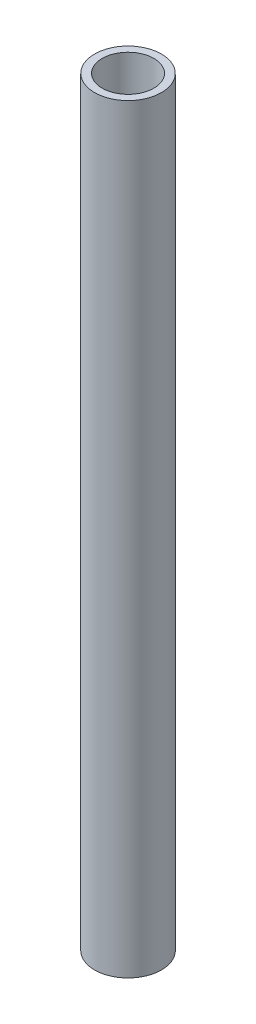
ISO-10303-21;
HEADER;
FILE_DESCRIPTION(('STEP AP214'),'2;1');
FILE_NAME('part.step','',(''),(''),'','','');
FILE_SCHEMA(('AUTOMOTIVE_DESIGN { 1 0 10303 214 1 1 1 1 }'));
ENDSEC;
DATA;
#1=APPLICATION_CONTEXT('core data for automotive mechanical design processes');
#2=APPLICATION_PROTOCOL_DEFINITION('international standard','automotive_design',2000,#1);
#3=PRODUCT_CONTEXT('',#1,'mechanical');
#4=PRODUCT('Part','Part','',(#3));
#5=PRODUCT_RELATED_PRODUCT_CATEGORY('part','',(#4));
#6=PRODUCT_DEFINITION_FORMATION('','',#4);
#7=PRODUCT_DEFINITION_CONTEXT('part definition',#1,'design');
#8=PRODUCT_DEFINITION('design','',#6,#7);
#9=PRODUCT_DEFINITION_SHAPE('','',#8);
#10=(LENGTH_UNIT() NAMED_UNIT(*) SI_UNIT(.MILLI.,.METRE.));
#11=(NAMED_UNIT(*) PLANE_ANGLE_UNIT() SI_UNIT($,.RADIAN.));
#12=(NAMED_UNIT(*) SI_UNIT($,.STERADIAN.) SOLID_ANGLE_UNIT());
#13=UNCERTAINTY_MEASURE_WITH_UNIT(LENGTH_MEASURE(1.E-05),#10,'distance_accuracy_value','');
#14=(GEOMETRIC_REPRESENTATION_CONTEXT(3) GLOBAL_UNCERTAINTY_ASSIGNED_CONTEXT((#13)) GLOBAL_UNIT_ASSIGNED_CONTEXT((#10,
#11,#12)) REPRESENTATION_CONTEXT('',''));
#15=CARTESIAN_POINT('',(0.,0.,0.));
#16=DIRECTION('',(0.,0.,1.));
#17=DIRECTION('',(1.,0.,0.));
#18=AXIS2_PLACEMENT_3D('',#15,#16,#17);
#19=CARTESIAN_POINT('',(0.,300.,0.));
#20=DIRECTION('',(0.,1.,0.));
#21=DIRECTION('',(0.,0.,1.));
#22=AXIS2_PLACEMENT_3D('',#19,#20,#21);
#23=PLANE('',#22);
#24=CARTESIAN_POINT('',(0.,300.,0.));
#25=DIRECTION('',(0.,1.,0.));
#26=DIRECTION('',(1.,0.,0.));
#27=AXIS2_PLACEMENT_3D('',#24,#25,#26);
#28=CIRCLE('',#27,13.2);
#29=CARTESIAN_POINT('',(13.2,300.,0.));
#30=VERTEX_POINT('',#29);
#31=EDGE_CURVE('E11',#30,#30,#28,.T.);
#32=ORIENTED_EDGE('',*,*,#31,.T.);
#33=EDGE_LOOP('',(#32));
#34=FACE_BOUND('',#33,.T.);
#35=CARTESIAN_POINT('',(0.,300.,0.));
#36=DIRECTION('',(0.,1.,0.));
#37=DIRECTION('',(0.,0.,1.));
#38=AXIS2_PLACEMENT_3D('',#35,#36,#37);
#39=CIRCLE('',#38,10.2);
#40=CARTESIAN_POINT('',(0.,300.,10.2));
#41=VERTEX_POINT('',#40);
#42=EDGE_CURVE('E48',#41,#41,#39,.T.);
#43=ORIENTED_EDGE('',*,*,#42,.F.);
#44=EDGE_LOOP('',(#43));
#45=FACE_BOUND('',#44,.T.);
#46=ADVANCED_FACE('F37',(#34,#45),#23,.T.);
#47=CARTESIAN_POINT('',(0.,0.,0.));
#48=DIRECTION('',(0.,1.,0.));
#49=DIRECTION('',(0.,0.,1.));
#50=AXIS2_PLACEMENT_3D('',#47,#48,#49);
#51=PLANE('',#50);
#52=CARTESIAN_POINT('',(0.,0.,0.));
#53=DIRECTION('',(0.,1.,0.));
#54=DIRECTION('',(1.,0.,0.));
#55=AXIS2_PLACEMENT_3D('',#52,#53,#54);
#56=CIRCLE('',#55,13.2);
#57=CARTESIAN_POINT('',(13.2,0.,0.));
#58=VERTEX_POINT('',#57);
#59=EDGE_CURVE('E41',#58,#58,#56,.T.);
#60=ORIENTED_EDGE('',*,*,#59,.F.);
#61=EDGE_LOOP('',(#60));
#62=FACE_BOUND('',#61,.T.);
#63=CARTESIAN_POINT('',(0.,0.,0.));
#64=DIRECTION('',(0.,1.,0.));
#65=DIRECTION('',(0.,0.,1.));
#66=AXIS2_PLACEMENT_3D('',#63,#64,#65);
#67=CIRCLE('',#66,10.2);
#68=CARTESIAN_POINT('',(0.,0.,10.2));
#69=VERTEX_POINT('',#68);
#70=EDGE_CURVE('E50',#69,#69,#67,.T.);
#71=ORIENTED_EDGE('',*,*,#70,.T.);
#72=EDGE_LOOP('',(#71));
#73=FACE_BOUND('',#72,.T.);
#74=ADVANCED_FACE('F60',(#62,#73),#51,.F.);
#75=CARTESIAN_POINT('',(0.,300.,0.));
#76=DIRECTION('',(0.,-1.,0.));
#77=DIRECTION('',(0.,0.,-1.));
#78=AXIS2_PLACEMENT_3D('',#75,#76,#77);
#79=CYLINDRICAL_SURFACE('',#78,13.2);
#80=ORIENTED_EDGE('',*,*,#31,.F.);
#81=EDGE_LOOP('',(#80));
#82=FACE_BOUND('',#81,.T.);
#83=ORIENTED_EDGE('',*,*,#59,.T.);
#84=EDGE_LOOP('',(#83));
#85=FACE_BOUND('',#84,.T.);
#86=ADVANCED_FACE('F39',(#82,#85),#79,.T.);
#87=CARTESIAN_POINT('',(0.,300.,0.));
#88=DIRECTION('',(0.,-1.,0.));
#89=DIRECTION('',(0.,0.,-1.));
#90=AXIS2_PLACEMENT_3D('',#87,#88,#89);
#91=CYLINDRICAL_SURFACE('',#90,10.2);
#92=ORIENTED_EDGE('',*,*,#42,.T.);
#93=EDGE_LOOP('',(#92));
#94=FACE_BOUND('',#93,.T.);
#95=ORIENTED_EDGE('',*,*,#70,.F.);
#96=EDGE_LOOP('',(#95));
#97=FACE_BOUND('',#96,.T.);
#98=ADVANCED_FACE('F56',(#94,#97),#91,.F.);
#99=CLOSED_SHELL('',(#46,#74,#86,#98));
#100=MANIFOLD_SOLID_BREP('B2',#99);
#101=ADVANCED_BREP_SHAPE_REPRESENTATION('',(#18,#100),#14);
#102=SHAPE_DEFINITION_REPRESENTATION(#9,#101);
ENDSEC;
END-ISO-10303-21;
